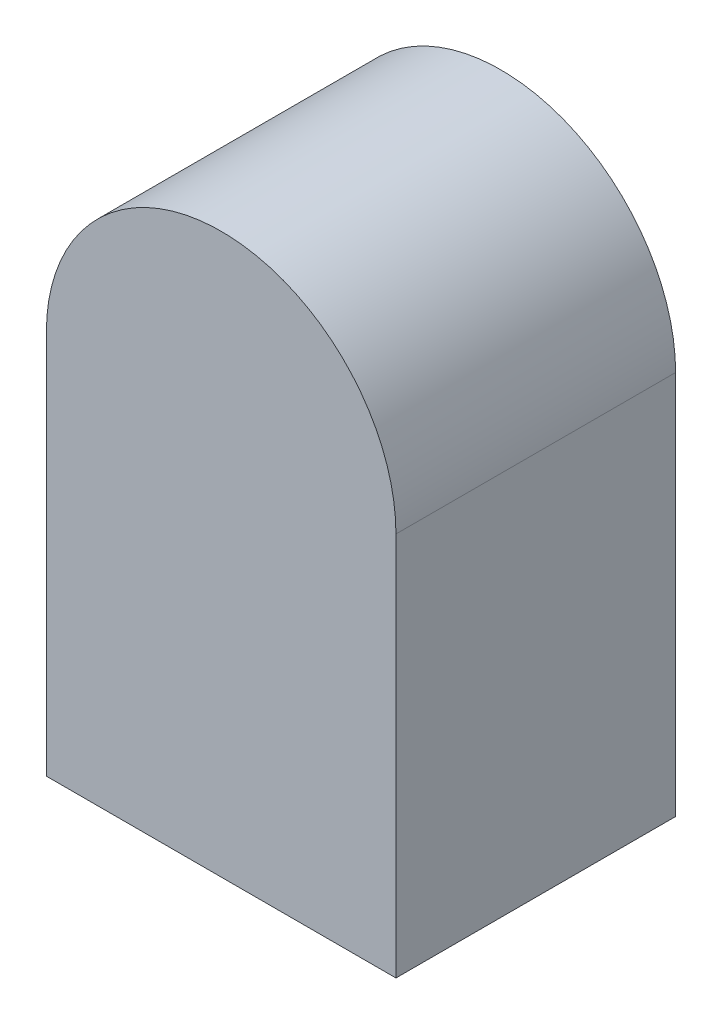
ISO-10303-21;
HEADER;
FILE_DESCRIPTION(('STEP AP214'),'2;1');
FILE_NAME('part.step','',(''),(''),'','','');
FILE_SCHEMA(('AUTOMOTIVE_DESIGN { 1 0 10303 214 1 1 1 1 }'));
ENDSEC;
DATA;
#1=APPLICATION_CONTEXT('core data for automotive mechanical design processes');
#2=APPLICATION_PROTOCOL_DEFINITION('international standard','automotive_design',2000,#1);
#3=PRODUCT_CONTEXT('',#1,'mechanical');
#4=PRODUCT('Part','Part','',(#3));
#5=PRODUCT_RELATED_PRODUCT_CATEGORY('part','',(#4));
#6=PRODUCT_DEFINITION_FORMATION('','',#4);
#7=PRODUCT_DEFINITION_CONTEXT('part definition',#1,'design');
#8=PRODUCT_DEFINITION('design','',#6,#7);
#9=PRODUCT_DEFINITION_SHAPE('','',#8);
#10=(LENGTH_UNIT() NAMED_UNIT(*) SI_UNIT(.MILLI.,.METRE.));
#11=(NAMED_UNIT(*) PLANE_ANGLE_UNIT() SI_UNIT($,.RADIAN.));
#12=(NAMED_UNIT(*) SI_UNIT($,.STERADIAN.) SOLID_ANGLE_UNIT());
#13=UNCERTAINTY_MEASURE_WITH_UNIT(LENGTH_MEASURE(1.E-05),#10,'distance_accuracy_value','');
#14=(GEOMETRIC_REPRESENTATION_CONTEXT(3) GLOBAL_UNCERTAINTY_ASSIGNED_CONTEXT((#13)) GLOBAL_UNIT_ASSIGNED_CONTEXT((#10,
#11,#12)) REPRESENTATION_CONTEXT('',''));
#15=CARTESIAN_POINT('',(0.,0.,0.));
#16=DIRECTION('',(0.,0.,1.));
#17=DIRECTION('',(1.,0.,0.));
#18=AXIS2_PLACEMENT_3D('',#15,#16,#17);
#19=CARTESIAN_POINT('',(0.625000000000002,-1.,0.));
#20=DIRECTION('',(1.,0.,0.));
#21=DIRECTION('',(0.,1.,0.));
#22=AXIS2_PLACEMENT_3D('',#19,#20,#21);
#23=PLANE('',#22);
#24=DIRECTION('',(0.,1.,0.));
#25=VECTOR('',#24,1.);
#26=CARTESIAN_POINT('',(0.625000000000002,-1.,0.));
#27=LINE('',#26,#25);
#28=CARTESIAN_POINT('',(0.625000000000002,-1.,0.));
#29=VERTEX_POINT('',#28);
#30=CARTESIAN_POINT('',(0.625000000000001,-0.724999999999999,0.));
#31=VERTEX_POINT('',#30);
#32=EDGE_CURVE('E11',#29,#31,#27,.T.);
#33=ORIENTED_EDGE('',*,*,#32,.T.);
#34=DIRECTION('',(0.,0.,1.));
#35=VECTOR('',#34,1.);
#36=CARTESIAN_POINT('',(0.625000000000001,-0.724999999999999,0.));
#37=LINE('',#36,#35);
#38=CARTESIAN_POINT('',(0.625000000000001,-0.724999999999999,0.2));
#39=VERTEX_POINT('',#38);
#40=EDGE_CURVE('E24',#31,#39,#37,.T.);
#41=ORIENTED_EDGE('',*,*,#40,.T.);
#42=DIRECTION('',(0.,1.,0.));
#43=VECTOR('',#42,1.);
#44=CARTESIAN_POINT('',(0.625000000000002,-1.,0.2));
#45=LINE('',#44,#43);
#46=CARTESIAN_POINT('',(0.625000000000002,-1.,0.2));
#47=VERTEX_POINT('',#46);
#48=EDGE_CURVE('E75',#47,#39,#45,.T.);
#49=ORIENTED_EDGE('',*,*,#48,.F.);
#50=DIRECTION('',(0.,0.,1.));
#51=VECTOR('',#50,1.);
#52=CARTESIAN_POINT('',(0.625000000000002,-1.,0.));
#53=LINE('',#52,#51);
#54=EDGE_CURVE('E86',#29,#47,#53,.T.);
#55=ORIENTED_EDGE('',*,*,#54,.F.);
#56=EDGE_LOOP('',(#33,#41,#49,#55));
#57=FACE_BOUND('',#56,.T.);
#58=ADVANCED_FACE('F17',(#57),#23,.T.);
#59=CARTESIAN_POINT('',(0.375000000000003,-1.,0.));
#60=DIRECTION('',(0.,-1.,0.));
#61=DIRECTION('',(1.,0.,0.));
#62=AXIS2_PLACEMENT_3D('',#59,#60,#61);
#63=PLANE('',#62);
#64=DIRECTION('',(1.,0.,0.));
#65=VECTOR('',#64,1.);
#66=CARTESIAN_POINT('',(0.375000000000003,-1.,0.));
#67=LINE('',#66,#65);
#68=CARTESIAN_POINT('',(0.375000000000003,-1.,0.));
#69=VERTEX_POINT('',#68);
#70=EDGE_CURVE('E83',#69,#29,#67,.T.);
#71=ORIENTED_EDGE('',*,*,#70,.T.);
#72=ORIENTED_EDGE('',*,*,#54,.T.);
#73=DIRECTION('',(1.,0.,0.));
#74=VECTOR('',#73,1.);
#75=CARTESIAN_POINT('',(0.375000000000003,-1.,0.2));
#76=LINE('',#75,#74);
#77=CARTESIAN_POINT('',(0.375000000000003,-1.,0.2));
#78=VERTEX_POINT('',#77);
#79=EDGE_CURVE('E81',#78,#47,#76,.T.);
#80=ORIENTED_EDGE('',*,*,#79,.F.);
#81=DIRECTION('',(0.,0.,1.));
#82=VECTOR('',#81,1.);
#83=CARTESIAN_POINT('',(0.375000000000003,-1.,0.));
#84=LINE('',#83,#82);
#85=EDGE_CURVE('E61',#69,#78,#84,.T.);
#86=ORIENTED_EDGE('',*,*,#85,.F.);
#87=EDGE_LOOP('',(#71,#72,#80,#86));
#88=FACE_BOUND('',#87,.T.);
#89=ADVANCED_FACE('F91',(#88),#63,.T.);
#90=CARTESIAN_POINT('',(0.375000000000003,-0.725,0.));
#91=DIRECTION('',(-1.,0.,0.));
#92=DIRECTION('',(0.,-1.,0.));
#93=AXIS2_PLACEMENT_3D('',#90,#91,#92);
#94=PLANE('',#93);
#95=DIRECTION('',(0.,-1.,0.));
#96=VECTOR('',#95,1.);
#97=CARTESIAN_POINT('',(0.375000000000003,-0.725,0.));
#98=LINE('',#97,#96);
#99=CARTESIAN_POINT('',(0.375000000000003,-0.725,0.));
#100=VERTEX_POINT('',#99);
#101=EDGE_CURVE('E65',#100,#69,#98,.T.);
#102=ORIENTED_EDGE('',*,*,#101,.T.);
#103=ORIENTED_EDGE('',*,*,#85,.T.);
#104=DIRECTION('',(0.,-1.,0.));
#105=VECTOR('',#104,1.);
#106=CARTESIAN_POINT('',(0.375000000000003,-0.725,0.2));
#107=LINE('',#106,#105);
#108=CARTESIAN_POINT('',(0.375000000000003,-0.725,0.2));
#109=VERTEX_POINT('',#108);
#110=EDGE_CURVE('E54',#109,#78,#107,.T.);
#111=ORIENTED_EDGE('',*,*,#110,.F.);
#112=DIRECTION('',(0.,0.,1.));
#113=VECTOR('',#112,1.);
#114=CARTESIAN_POINT('',(0.375000000000003,-0.725,0.));
#115=LINE('',#114,#113);
#116=EDGE_CURVE('E58',#100,#109,#115,.T.);
#117=ORIENTED_EDGE('',*,*,#116,.F.);
#118=EDGE_LOOP('',(#102,#103,#111,#117));
#119=FACE_BOUND('',#118,.T.);
#120=ADVANCED_FACE('F57',(#119),#94,.T.);
#121=CARTESIAN_POINT('',(0.500000000000003,-0.724999999999999,0.));
#122=DIRECTION('',(0.,0.,1.));
#123=DIRECTION('',(1.,0.,0.));
#124=AXIS2_PLACEMENT_3D('',#121,#122,#123);
#125=CYLINDRICAL_SURFACE('',#124,0.125);
#126=CARTESIAN_POINT('',(0.500000000000003,-0.724999999999999,0.));
#127=DIRECTION('',(0.,0.,1.));
#128=DIRECTION('',(1.,0.,0.));
#129=AXIS2_PLACEMENT_3D('',#126,#127,#128);
#130=CIRCLE('',#129,0.125);
#131=EDGE_CURVE('E71',#31,#100,#130,.T.);
#132=ORIENTED_EDGE('',*,*,#131,.T.);
#133=ORIENTED_EDGE('',*,*,#116,.T.);
#134=CARTESIAN_POINT('',(0.500000000000003,-0.724999999999999,0.2));
#135=DIRECTION('',(0.,0.,1.));
#136=DIRECTION('',(1.,0.,0.));
#137=AXIS2_PLACEMENT_3D('',#134,#135,#136);
#138=CIRCLE('',#137,0.125);
#139=EDGE_CURVE('E70',#39,#109,#138,.T.);
#140=ORIENTED_EDGE('',*,*,#139,.F.);
#141=ORIENTED_EDGE('',*,*,#40,.F.);
#142=EDGE_LOOP('',(#132,#133,#140,#141));
#143=FACE_BOUND('',#142,.T.);
#144=ADVANCED_FACE('F69',(#143),#125,.T.);
#145=CARTESIAN_POINT('',(0.500000000000003,-0.8,0.2));
#146=DIRECTION('',(0.,0.,1.));
#147=DIRECTION('',(1.,0.,0.));
#148=AXIS2_PLACEMENT_3D('',#145,#146,#147);
#149=PLANE('',#148);
#150=ORIENTED_EDGE('',*,*,#139,.T.);
#151=ORIENTED_EDGE('',*,*,#110,.T.);
#152=ORIENTED_EDGE('',*,*,#79,.T.);
#153=ORIENTED_EDGE('',*,*,#48,.T.);
#154=EDGE_LOOP('',(#150,#151,#152,#153));
#155=FACE_BOUND('',#154,.T.);
#156=ADVANCED_FACE('F74',(#155),#149,.T.);
#157=CARTESIAN_POINT('',(0.500000000000003,-0.8,0.));
#158=DIRECTION('',(0.,0.,1.));
#159=DIRECTION('',(1.,0.,0.));
#160=AXIS2_PLACEMENT_3D('',#157,#158,#159);
#161=PLANE('',#160);
#162=ORIENTED_EDGE('',*,*,#131,.F.);
#163=ORIENTED_EDGE('',*,*,#32,.F.);
#164=ORIENTED_EDGE('',*,*,#70,.F.);
#165=ORIENTED_EDGE('',*,*,#101,.F.);
#166=EDGE_LOOP('',(#162,#163,#164,#165));
#167=FACE_BOUND('',#166,.T.);
#168=ADVANCED_FACE('F89',(#167),#161,.F.);
#169=CLOSED_SHELL('',(#58,#89,#120,#144,#156,#168));
#170=MANIFOLD_SOLID_BREP('B1',#169);
#171=ADVANCED_BREP_SHAPE_REPRESENTATION('',(#18,#170),#14);
#172=SHAPE_DEFINITION_REPRESENTATION(#9,#171);
ENDSEC;
END-ISO-10303-21;
